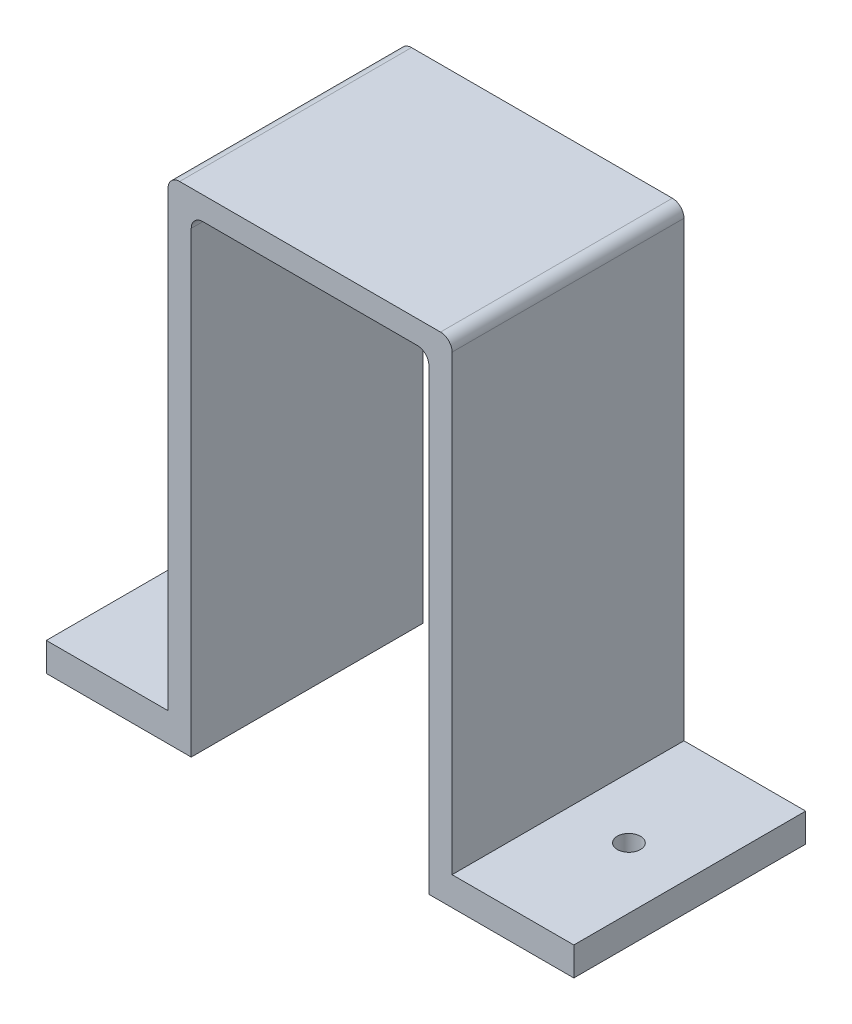
ISO-10303-21;
HEADER;
FILE_DESCRIPTION(('STEP AP214'),'2;1');
FILE_NAME('part.step','',(''),(''),'','','');
FILE_SCHEMA(('AUTOMOTIVE_DESIGN { 1 0 10303 214 1 1 1 1 }'));
ENDSEC;
DATA;
#1=APPLICATION_CONTEXT('core data for automotive mechanical design processes');
#2=APPLICATION_PROTOCOL_DEFINITION('international standard','automotive_design',2000,#1);
#3=PRODUCT_CONTEXT('',#1,'mechanical');
#4=PRODUCT('Part','Part','',(#3));
#5=PRODUCT_RELATED_PRODUCT_CATEGORY('part','',(#4));
#6=PRODUCT_DEFINITION_FORMATION('','',#4);
#7=PRODUCT_DEFINITION_CONTEXT('part definition',#1,'design');
#8=PRODUCT_DEFINITION('design','',#6,#7);
#9=PRODUCT_DEFINITION_SHAPE('','',#8);
#10=(LENGTH_UNIT() NAMED_UNIT(*) SI_UNIT(.MILLI.,.METRE.));
#11=(NAMED_UNIT(*) PLANE_ANGLE_UNIT() SI_UNIT($,.RADIAN.));
#12=(NAMED_UNIT(*) SI_UNIT($,.STERADIAN.) SOLID_ANGLE_UNIT());
#13=UNCERTAINTY_MEASURE_WITH_UNIT(LENGTH_MEASURE(1.E-05),#10,'distance_accuracy_value','');
#14=(GEOMETRIC_REPRESENTATION_CONTEXT(3) GLOBAL_UNCERTAINTY_ASSIGNED_CONTEXT((#13)) GLOBAL_UNIT_ASSIGNED_CONTEXT((#10,
#11,#12)) REPRESENTATION_CONTEXT('',''));
#15=CARTESIAN_POINT('',(0.,0.,0.));
#16=DIRECTION('',(0.,0.,1.));
#17=DIRECTION('',(1.,0.,0.));
#18=AXIS2_PLACEMENT_3D('',#15,#16,#17);
#19=CARTESIAN_POINT('',(-22.5,-10.2652354570637,20.));
#20=DIRECTION('',(-1.,0.,0.));
#21=DIRECTION('',(0.,-1.,0.));
#22=AXIS2_PLACEMENT_3D('',#19,#20,#21);
#23=PLANE('',#22);
#24=DIRECTION('',(0.,1.,0.));
#25=VECTOR('',#24,1.);
#26=CARTESIAN_POINT('',(-22.5,-10.2652354570637,0.));
#27=LINE('',#26,#25);
#28=CARTESIAN_POINT('',(-22.5,-10.2652354570637,0.));
#29=VERTEX_POINT('',#28);
#30=CARTESIAN_POINT('',(-22.5,29.2347645429363,0.));
#31=VERTEX_POINT('',#30);
#32=EDGE_CURVE('E163',#29,#31,#27,.T.);
#33=ORIENTED_EDGE('',*,*,#32,.T.);
#34=DIRECTION('',(0.,0.,-1.));
#35=VECTOR('',#34,1.);
#36=CARTESIAN_POINT('',(-22.5,29.2347645429363,20.));
#37=LINE('',#36,#35);
#38=CARTESIAN_POINT('',(-22.5,29.2347645429363,20.));
#39=VERTEX_POINT('',#38);
#40=EDGE_CURVE('E256',#31,#39,#37,.F.);
#41=ORIENTED_EDGE('',*,*,#40,.T.);
#42=DIRECTION('',(0.,1.,0.));
#43=VECTOR('',#42,1.);
#44=CARTESIAN_POINT('',(-22.5,-10.2652354570637,20.));
#45=LINE('',#44,#43);
#46=CARTESIAN_POINT('',(-22.5,-10.2652354570637,20.));
#47=VERTEX_POINT('',#46);
#48=EDGE_CURVE('E172',#47,#39,#45,.T.);
#49=ORIENTED_EDGE('',*,*,#48,.F.);
#50=DIRECTION('',(0.,0.,-1.));
#51=VECTOR('',#50,1.);
#52=CARTESIAN_POINT('',(-22.5,-10.2652354570637,20.));
#53=LINE('',#52,#51);
#54=EDGE_CURVE('E158',#47,#29,#53,.T.);
#55=ORIENTED_EDGE('',*,*,#54,.T.);
#56=EDGE_LOOP('',(#33,#41,#49,#55));
#57=FACE_BOUND('',#56,.T.);
#58=ADVANCED_FACE('F37',(#57),#23,.F.);
#59=CARTESIAN_POINT('',(-22.5,30.2347645429363,20.));
#60=DIRECTION('',(0.,1.,0.));
#61=DIRECTION('',(-1.,0.,0.));
#62=AXIS2_PLACEMENT_3D('',#59,#60,#61);
#63=PLANE('',#62);
#64=DIRECTION('',(1.,0.,0.));
#65=VECTOR('',#64,1.);
#66=CARTESIAN_POINT('',(-22.5,30.2347645429363,0.));
#67=LINE('',#66,#65);
#68=CARTESIAN_POINT('',(-21.5,30.2347645429363,0.));
#69=VERTEX_POINT('',#68);
#70=CARTESIAN_POINT('',(-3.,30.2347645429363,0.));
#71=VERTEX_POINT('',#70);
#72=EDGE_CURVE('E227',#69,#71,#67,.T.);
#73=ORIENTED_EDGE('',*,*,#72,.T.);
#74=DIRECTION('',(0.,0.,-1.));
#75=VECTOR('',#74,1.);
#76=CARTESIAN_POINT('',(-3.,30.2347645429363,20.));
#77=LINE('',#76,#75);
#78=CARTESIAN_POINT('',(-3.,30.2347645429363,20.));
#79=VERTEX_POINT('',#78);
#80=EDGE_CURVE('E254',#71,#79,#77,.F.);
#81=ORIENTED_EDGE('',*,*,#80,.T.);
#82=DIRECTION('',(1.,0.,0.));
#83=VECTOR('',#82,1.);
#84=CARTESIAN_POINT('',(-22.5,30.2347645429363,20.));
#85=LINE('',#84,#83);
#86=CARTESIAN_POINT('',(-21.5,30.2347645429363,20.));
#87=VERTEX_POINT('',#86);
#88=EDGE_CURVE('E198',#87,#79,#85,.T.);
#89=ORIENTED_EDGE('',*,*,#88,.F.);
#90=DIRECTION('',(0.,0.,-1.));
#91=VECTOR('',#90,1.);
#92=CARTESIAN_POINT('',(-21.5,30.2347645429363,0.));
#93=LINE('',#92,#91);
#94=EDGE_CURVE('E251',#87,#69,#93,.T.);
#95=ORIENTED_EDGE('',*,*,#94,.T.);
#96=EDGE_LOOP('',(#73,#81,#89,#95));
#97=FACE_BOUND('',#96,.T.);
#98=ADVANCED_FACE('F291',(#97),#63,.F.);
#99=CARTESIAN_POINT('',(-2.,30.2347645429363,20.));
#100=DIRECTION('',(1.,0.,0.));
#101=DIRECTION('',(0.,1.,0.));
#102=AXIS2_PLACEMENT_3D('',#99,#100,#101);
#103=PLANE('',#102);
#104=DIRECTION('',(0.,-1.,0.));
#105=VECTOR('',#104,1.);
#106=CARTESIAN_POINT('',(-2.,30.2347645429363,20.));
#107=LINE('',#106,#105);
#108=CARTESIAN_POINT('',(-2.,29.2347645429363,20.));
#109=VERTEX_POINT('',#108);
#110=CARTESIAN_POINT('',(-2.,-10.2652354570637,20.));
#111=VERTEX_POINT('',#110);
#112=EDGE_CURVE('E196',#109,#111,#107,.T.);
#113=ORIENTED_EDGE('',*,*,#112,.F.);
#114=DIRECTION('',(0.,0.,-1.));
#115=VECTOR('',#114,1.);
#116=CARTESIAN_POINT('',(-2.,29.2347645429363,0.));
#117=LINE('',#116,#115);
#118=CARTESIAN_POINT('',(-2.,29.2347645429363,0.));
#119=VERTEX_POINT('',#118);
#120=EDGE_CURVE('E233',#109,#119,#117,.T.);
#121=ORIENTED_EDGE('',*,*,#120,.T.);
#122=DIRECTION('',(0.,-1.,0.));
#123=VECTOR('',#122,1.);
#124=CARTESIAN_POINT('',(-2.,30.2347645429363,0.));
#125=LINE('',#124,#123);
#126=CARTESIAN_POINT('',(-2.,-10.2652354570637,0.));
#127=VERTEX_POINT('',#126);
#128=EDGE_CURVE('E225',#119,#127,#125,.T.);
#129=ORIENTED_EDGE('',*,*,#128,.T.);
#130=DIRECTION('',(0.,0.,-1.));
#131=VECTOR('',#130,1.);
#132=CARTESIAN_POINT('',(-2.,-10.2652354570637,20.));
#133=LINE('',#132,#131);
#134=EDGE_CURVE('E234',#111,#127,#133,.T.);
#135=ORIENTED_EDGE('',*,*,#134,.F.);
#136=EDGE_LOOP('',(#113,#121,#129,#135));
#137=FACE_BOUND('',#136,.T.);
#138=ADVANCED_FACE('F300',(#137),#103,.F.);
#139=CARTESIAN_POINT('',(0.,-10.2652354570637,20.));
#140=DIRECTION('',(0.,-1.,0.));
#141=DIRECTION('',(0.,0.,-1.));
#142=AXIS2_PLACEMENT_3D('',#139,#140,#141);
#143=PLANE('',#142);
#144=CARTESIAN_POINT('',(5.25,-10.2652354570637,10.));
#145=DIRECTION('',(0.,-1.,0.));
#146=DIRECTION('',(0.,0.,-1.));
#147=AXIS2_PLACEMENT_3D('',#144,#145,#146);
#148=CIRCLE('',#147,1.);
#149=CARTESIAN_POINT('',(5.25,-10.2652354570637,9.));
#150=VERTEX_POINT('',#149);
#151=EDGE_CURVE('E204',#150,#150,#148,.T.);
#152=ORIENTED_EDGE('',*,*,#151,.F.);
#153=EDGE_LOOP('',(#152));
#154=FACE_BOUND('',#153,.T.);
#155=DIRECTION('',(-1.,0.,0.));
#156=VECTOR('',#155,1.);
#157=CARTESIAN_POINT('',(0.,-10.2652354570637,0.));
#158=LINE('',#157,#156);
#159=CARTESIAN_POINT('',(10.5,-10.2652354570637,0.));
#160=VERTEX_POINT('',#159);
#161=EDGE_CURVE('E222',#160,#127,#158,.T.);
#162=ORIENTED_EDGE('',*,*,#161,.F.);
#163=DIRECTION('',(0.,0.,-1.));
#164=VECTOR('',#163,1.);
#165=CARTESIAN_POINT('',(10.5,-10.2652354570637,20.));
#166=LINE('',#165,#164);
#167=CARTESIAN_POINT('',(10.5,-10.2652354570637,20.));
#168=VERTEX_POINT('',#167);
#169=EDGE_CURVE('E237',#168,#160,#166,.T.);
#170=ORIENTED_EDGE('',*,*,#169,.F.);
#171=DIRECTION('',(1.,0.,0.));
#172=VECTOR('',#171,1.);
#173=CARTESIAN_POINT('',(0.,-10.2652354570637,20.));
#174=LINE('',#173,#172);
#175=EDGE_CURVE('E194',#111,#168,#174,.T.);
#176=ORIENTED_EDGE('',*,*,#175,.F.);
#177=ORIENTED_EDGE('',*,*,#134,.T.);
#178=EDGE_LOOP('',(#162,#170,#176,#177));
#179=FACE_BOUND('',#178,.T.);
#180=ADVANCED_FACE('F303',(#154,#179),#143,.T.);
#181=CARTESIAN_POINT('',(10.5,-10.2652354570637,20.));
#182=DIRECTION('',(-1.,0.,0.));
#183=DIRECTION('',(0.,0.,1.));
#184=AXIS2_PLACEMENT_3D('',#181,#182,#183);
#185=PLANE('',#184);
#186=DIRECTION('',(0.,1.,0.));
#187=VECTOR('',#186,1.);
#188=CARTESIAN_POINT('',(10.5,-10.2652354570637,0.));
#189=LINE('',#188,#187);
#190=CARTESIAN_POINT('',(10.5,-7.79709141274239,0.));
#191=VERTEX_POINT('',#190);
#192=EDGE_CURVE('E220',#160,#191,#189,.T.);
#193=ORIENTED_EDGE('',*,*,#192,.T.);
#194=DIRECTION('',(0.,0.,-1.));
#195=VECTOR('',#194,1.);
#196=CARTESIAN_POINT('',(10.5,-7.79709141274239,20.));
#197=LINE('',#196,#195);
#198=CARTESIAN_POINT('',(10.5,-7.79709141274239,20.));
#199=VERTEX_POINT('',#198);
#200=EDGE_CURVE('E240',#199,#191,#197,.T.);
#201=ORIENTED_EDGE('',*,*,#200,.F.);
#202=DIRECTION('',(0.,1.,0.));
#203=VECTOR('',#202,1.);
#204=CARTESIAN_POINT('',(10.5,-10.2652354570637,20.));
#205=LINE('',#204,#203);
#206=EDGE_CURVE('E192',#168,#199,#205,.T.);
#207=ORIENTED_EDGE('',*,*,#206,.F.);
#208=ORIENTED_EDGE('',*,*,#169,.T.);
#209=EDGE_LOOP('',(#193,#201,#207,#208));
#210=FACE_BOUND('',#209,.T.);
#211=ADVANCED_FACE('F309',(#210),#185,.F.);
#212=CARTESIAN_POINT('',(10.5,-7.79709141274239,20.));
#213=DIRECTION('',(0.,-1.,0.));
#214=DIRECTION('',(1.,0.,0.));
#215=AXIS2_PLACEMENT_3D('',#212,#213,#214);
#216=PLANE('',#215);
#217=CARTESIAN_POINT('',(5.25,-7.79709141274239,10.));
#218=DIRECTION('',(0.,1.,0.));
#219=DIRECTION('',(0.,0.,1.));
#220=AXIS2_PLACEMENT_3D('',#217,#218,#219);
#221=CIRCLE('',#220,1.);
#222=CARTESIAN_POINT('',(5.25,-7.79709141274239,11.));
#223=VERTEX_POINT('',#222);
#224=EDGE_CURVE('E550',#223,#223,#221,.T.);
#225=ORIENTED_EDGE('',*,*,#224,.F.);
#226=EDGE_LOOP('',(#225));
#227=FACE_BOUND('',#226,.T.);
#228=DIRECTION('',(-1.,0.,0.));
#229=VECTOR('',#228,1.);
#230=CARTESIAN_POINT('',(10.5,-7.79709141274239,0.));
#231=LINE('',#230,#229);
#232=CARTESIAN_POINT('',(0.,-7.79709141274239,0.));
#233=VERTEX_POINT('',#232);
#234=EDGE_CURVE('E217',#191,#233,#231,.T.);
#235=ORIENTED_EDGE('',*,*,#234,.T.);
#236=DIRECTION('',(0.,0.,-1.));
#237=VECTOR('',#236,1.);
#238=CARTESIAN_POINT('',(0.,-7.79709141274239,20.));
#239=LINE('',#238,#237);
#240=CARTESIAN_POINT('',(0.,-7.79709141274239,20.));
#241=VERTEX_POINT('',#240);
#242=EDGE_CURVE('E243',#241,#233,#239,.T.);
#243=ORIENTED_EDGE('',*,*,#242,.F.);
#244=DIRECTION('',(-1.,0.,0.));
#245=VECTOR('',#244,1.);
#246=CARTESIAN_POINT('',(10.5,-7.79709141274239,20.));
#247=LINE('',#246,#245);
#248=EDGE_CURVE('E189',#199,#241,#247,.T.);
#249=ORIENTED_EDGE('',*,*,#248,.F.);
#250=ORIENTED_EDGE('',*,*,#200,.T.);
#251=EDGE_LOOP('',(#235,#243,#249,#250));
#252=FACE_BOUND('',#251,.T.);
#253=ADVANCED_FACE('F313',(#227,#252),#216,.F.);
#254=CARTESIAN_POINT('',(0.,32.2347645429363,20.));
#255=DIRECTION('',(1.,0.,0.));
#256=DIRECTION('',(0.,0.,-1.));
#257=AXIS2_PLACEMENT_3D('',#254,#255,#256);
#258=PLANE('',#257);
#259=DIRECTION('',(0.,-1.,0.));
#260=VECTOR('',#259,1.);
#261=CARTESIAN_POINT('',(0.,32.2347645429363,0.));
#262=LINE('',#261,#260);
#263=CARTESIAN_POINT('',(0.,31.2347645429363,0.));
#264=VERTEX_POINT('',#263);
#265=EDGE_CURVE('E215',#264,#233,#262,.T.);
#266=ORIENTED_EDGE('',*,*,#265,.F.);
#267=DIRECTION('',(0.,0.,-1.));
#268=VECTOR('',#267,1.);
#269=CARTESIAN_POINT('',(0.,31.2347645429363,20.));
#270=LINE('',#269,#268);
#271=CARTESIAN_POINT('',(0.,31.2347645429363,20.));
#272=VERTEX_POINT('',#271);
#273=EDGE_CURVE('E61',#264,#272,#270,.F.);
#274=ORIENTED_EDGE('',*,*,#273,.T.);
#275=DIRECTION('',(0.,-1.,0.));
#276=VECTOR('',#275,1.);
#277=CARTESIAN_POINT('',(0.,32.2347645429363,20.));
#278=LINE('',#277,#276);
#279=EDGE_CURVE('E187',#272,#241,#278,.T.);
#280=ORIENTED_EDGE('',*,*,#279,.T.);
#281=ORIENTED_EDGE('',*,*,#242,.T.);
#282=EDGE_LOOP('',(#266,#274,#280,#281));
#283=FACE_BOUND('',#282,.T.);
#284=ADVANCED_FACE('F359',(#283),#258,.T.);
#285=CARTESIAN_POINT('',(-24.5,32.2347645429363,20.));
#286=DIRECTION('',(0.,1.,0.));
#287=DIRECTION('',(0.,0.,1.));
#288=AXIS2_PLACEMENT_3D('',#285,#286,#287);
#289=PLANE('',#288);
#290=DIRECTION('',(1.,0.,0.));
#291=VECTOR('',#290,1.);
#292=CARTESIAN_POINT('',(-24.5,32.2347645429363,20.));
#293=LINE('',#292,#291);
#294=CARTESIAN_POINT('',(-23.5,32.2347645429363,20.));
#295=VERTEX_POINT('',#294);
#296=CARTESIAN_POINT('',(-1.,32.2347645429363,20.));
#297=VERTEX_POINT('',#296);
#298=EDGE_CURVE('E184',#295,#297,#293,.T.);
#299=ORIENTED_EDGE('',*,*,#298,.T.);
#300=DIRECTION('',(0.,0.,-1.));
#301=VECTOR('',#300,1.);
#302=CARTESIAN_POINT('',(-1.,32.2347645429363,20.));
#303=LINE('',#302,#301);
#304=CARTESIAN_POINT('',(-1.,32.2347645429363,0.));
#305=VERTEX_POINT('',#304);
#306=EDGE_CURVE('E260',#297,#305,#303,.T.);
#307=ORIENTED_EDGE('',*,*,#306,.T.);
#308=DIRECTION('',(1.,0.,0.));
#309=VECTOR('',#308,1.);
#310=CARTESIAN_POINT('',(-24.5,32.2347645429363,0.));
#311=LINE('',#310,#309);
#312=CARTESIAN_POINT('',(-23.5,32.2347645429363,0.));
#313=VERTEX_POINT('',#312);
#314=EDGE_CURVE('E212',#313,#305,#311,.T.);
#315=ORIENTED_EDGE('',*,*,#314,.F.);
#316=DIRECTION('',(0.,0.,-1.));
#317=VECTOR('',#316,1.);
#318=CARTESIAN_POINT('',(-23.5,32.2347645429363,20.));
#319=LINE('',#318,#317);
#320=EDGE_CURVE('E258',#313,#295,#319,.F.);
#321=ORIENTED_EDGE('',*,*,#320,.T.);
#322=EDGE_LOOP('',(#299,#307,#315,#321));
#323=FACE_BOUND('',#322,.T.);
#324=ADVANCED_FACE('F321',(#323),#289,.T.);
#325=CARTESIAN_POINT('',(-24.5,-7.79709141274239,20.));
#326=DIRECTION('',(-1.,0.,0.));
#327=DIRECTION('',(0.,0.,1.));
#328=AXIS2_PLACEMENT_3D('',#325,#326,#327);
#329=PLANE('',#328);
#330=DIRECTION('',(0.,1.,0.));
#331=VECTOR('',#330,1.);
#332=CARTESIAN_POINT('',(-24.5,-7.79709141274239,20.));
#333=LINE('',#332,#331);
#334=CARTESIAN_POINT('',(-24.5,-7.79709141274239,20.));
#335=VERTEX_POINT('',#334);
#336=CARTESIAN_POINT('',(-24.5,31.2347645429363,20.));
#337=VERTEX_POINT('',#336);
#338=EDGE_CURVE('E179',#335,#337,#333,.T.);
#339=ORIENTED_EDGE('',*,*,#338,.T.);
#340=DIRECTION('',(0.,0.,-1.));
#341=VECTOR('',#340,1.);
#342=CARTESIAN_POINT('',(-24.5,31.2347645429363,20.));
#343=LINE('',#342,#341);
#344=CARTESIAN_POINT('',(-24.5,31.2347645429363,0.));
#345=VERTEX_POINT('',#344);
#346=EDGE_CURVE('E271',#337,#345,#343,.T.);
#347=ORIENTED_EDGE('',*,*,#346,.T.);
#348=DIRECTION('',(0.,1.,0.));
#349=VECTOR('',#348,1.);
#350=CARTESIAN_POINT('',(-24.5,-7.79709141274239,0.));
#351=LINE('',#350,#349);
#352=CARTESIAN_POINT('',(-24.5,-7.79709141274239,0.));
#353=VERTEX_POINT('',#352);
#354=EDGE_CURVE('E209',#353,#345,#351,.T.);
#355=ORIENTED_EDGE('',*,*,#354,.F.);
#356=DIRECTION('',(0.,0.,-1.));
#357=VECTOR('',#356,1.);
#358=CARTESIAN_POINT('',(-24.5,-7.79709141274239,20.));
#359=LINE('',#358,#357);
#360=EDGE_CURVE('E246',#335,#353,#359,.T.);
#361=ORIENTED_EDGE('',*,*,#360,.F.);
#362=EDGE_LOOP('',(#339,#347,#355,#361));
#363=FACE_BOUND('',#362,.T.);
#364=ADVANCED_FACE('F327',(#363),#329,.T.);
#365=CARTESIAN_POINT('',(-35.,-7.79709141274239,20.));
#366=DIRECTION('',(0.,1.,0.));
#367=DIRECTION('',(0.,0.,1.));
#368=AXIS2_PLACEMENT_3D('',#365,#366,#367);
#369=PLANE('',#368);
#370=CARTESIAN_POINT('',(-29.75,-7.79709141274239,10.));
#371=DIRECTION('',(0.,1.,0.));
#372=DIRECTION('',(0.,0.,1.));
#373=AXIS2_PLACEMENT_3D('',#370,#371,#372);
#374=CIRCLE('',#373,1.);
#375=CARTESIAN_POINT('',(-29.75,-7.79709141274239,11.));
#376=VERTEX_POINT('',#375);
#377=EDGE_CURVE('E551',#376,#376,#374,.T.);
#378=ORIENTED_EDGE('',*,*,#377,.F.);
#379=EDGE_LOOP('',(#378));
#380=FACE_BOUND('',#379,.T.);
#381=DIRECTION('',(1.,0.,0.));
#382=VECTOR('',#381,1.);
#383=CARTESIAN_POINT('',(-35.,-7.79709141274239,0.));
#384=LINE('',#383,#382);
#385=CARTESIAN_POINT('',(-35.,-7.79709141274239,0.));
#386=VERTEX_POINT('',#385);
#387=EDGE_CURVE('E206',#386,#353,#384,.T.);
#388=ORIENTED_EDGE('',*,*,#387,.F.);
#389=DIRECTION('',(0.,0.,-1.));
#390=VECTOR('',#389,1.);
#391=CARTESIAN_POINT('',(-35.,-7.79709141274239,20.));
#392=LINE('',#391,#390);
#393=CARTESIAN_POINT('',(-35.,-7.79709141274239,20.));
#394=VERTEX_POINT('',#393);
#395=EDGE_CURVE('E171',#394,#386,#392,.T.);
#396=ORIENTED_EDGE('',*,*,#395,.F.);
#397=DIRECTION('',(1.,0.,0.));
#398=VECTOR('',#397,1.);
#399=CARTESIAN_POINT('',(-35.,-7.79709141274239,20.));
#400=LINE('',#399,#398);
#401=EDGE_CURVE('E177',#394,#335,#400,.T.);
#402=ORIENTED_EDGE('',*,*,#401,.T.);
#403=ORIENTED_EDGE('',*,*,#360,.T.);
#404=EDGE_LOOP('',(#388,#396,#402,#403));
#405=FACE_BOUND('',#404,.T.);
#406=ADVANCED_FACE('F330',(#380,#405),#369,.T.);
#407=CARTESIAN_POINT('',(-35.,-10.2652354570637,20.));
#408=DIRECTION('',(-1.,0.,0.));
#409=DIRECTION('',(0.,0.,1.));
#410=AXIS2_PLACEMENT_3D('',#407,#408,#409);
#411=PLANE('',#410);
#412=DIRECTION('',(0.,1.,0.));
#413=VECTOR('',#412,1.);
#414=CARTESIAN_POINT('',(-35.,-10.2652354570637,0.));
#415=LINE('',#414,#413);
#416=CARTESIAN_POINT('',(-35.,-10.2652354570637,0.));
#417=VERTEX_POINT('',#416);
#418=EDGE_CURVE('E169',#417,#386,#415,.T.);
#419=ORIENTED_EDGE('',*,*,#418,.F.);
#420=DIRECTION('',(0.,0.,-1.));
#421=VECTOR('',#420,1.);
#422=CARTESIAN_POINT('',(-35.,-10.2652354570637,20.));
#423=LINE('',#422,#421);
#424=CARTESIAN_POINT('',(-35.,-10.2652354570637,20.));
#425=VERTEX_POINT('',#424);
#426=EDGE_CURVE('E155',#425,#417,#423,.T.);
#427=ORIENTED_EDGE('',*,*,#426,.F.);
#428=DIRECTION('',(0.,1.,0.));
#429=VECTOR('',#428,1.);
#430=CARTESIAN_POINT('',(-35.,-10.2652354570637,20.));
#431=LINE('',#430,#429);
#432=EDGE_CURVE('E162',#425,#394,#431,.T.);
#433=ORIENTED_EDGE('',*,*,#432,.T.);
#434=ORIENTED_EDGE('',*,*,#395,.T.);
#435=EDGE_LOOP('',(#419,#427,#433,#434));
#436=FACE_BOUND('',#435,.T.);
#437=ADVANCED_FACE('F167',(#436),#411,.T.);
#438=CARTESIAN_POINT('',(-26.0678670360111,-10.2652354570637,20.));
#439=DIRECTION('',(0.,-1.,0.));
#440=DIRECTION('',(0.,0.,-1.));
#441=AXIS2_PLACEMENT_3D('',#438,#439,#440);
#442=PLANE('',#441);
#443=CARTESIAN_POINT('',(-29.75,-10.2652354570637,10.));
#444=DIRECTION('',(0.,-1.,0.));
#445=DIRECTION('',(0.,0.,-1.));
#446=AXIS2_PLACEMENT_3D('',#443,#444,#445);
#447=CIRCLE('',#446,1.);
#448=CARTESIAN_POINT('',(-29.75,-10.2652354570637,9.));
#449=VERTEX_POINT('',#448);
#450=EDGE_CURVE('E41',#449,#449,#447,.T.);
#451=ORIENTED_EDGE('',*,*,#450,.F.);
#452=EDGE_LOOP('',(#451));
#453=FACE_BOUND('',#452,.T.);
#454=DIRECTION('',(-1.,0.,0.));
#455=VECTOR('',#454,1.);
#456=CARTESIAN_POINT('',(-26.0678670360111,-10.2652354570637,0.));
#457=LINE('',#456,#455);
#458=EDGE_CURVE('E202',#29,#417,#457,.T.);
#459=ORIENTED_EDGE('',*,*,#458,.F.);
#460=ORIENTED_EDGE('',*,*,#54,.F.);
#461=DIRECTION('',(-1.,0.,0.));
#462=VECTOR('',#461,1.);
#463=CARTESIAN_POINT('',(-22.5,-10.2652354570637,20.));
#464=LINE('',#463,#462);
#465=EDGE_CURVE('E152',#47,#425,#464,.T.);
#466=ORIENTED_EDGE('',*,*,#465,.T.);
#467=ORIENTED_EDGE('',*,*,#426,.T.);
#468=EDGE_LOOP('',(#459,#460,#466,#467));
#469=FACE_BOUND('',#468,.T.);
#470=ADVANCED_FACE('F154',(#453,#469),#442,.T.);
#471=CARTESIAN_POINT('',(0.,0.,20.));
#472=DIRECTION('',(0.,0.,-1.));
#473=DIRECTION('',(-1.,0.,0.));
#474=AXIS2_PLACEMENT_3D('',#471,#472,#473);
#475=PLANE('',#474);
#476=ORIENTED_EDGE('',*,*,#279,.F.);
#477=CARTESIAN_POINT('',(-1.,31.2347645429363,20.));
#478=DIRECTION('',(0.,0.,-1.));
#479=DIRECTION('',(-1.,0.,0.));
#480=AXIS2_PLACEMENT_3D('',#477,#478,#479);
#481=CIRCLE('',#480,1.);
#482=EDGE_CURVE('E269',#272,#297,#481,.F.);
#483=ORIENTED_EDGE('',*,*,#482,.T.);
#484=ORIENTED_EDGE('',*,*,#298,.F.);
#485=CARTESIAN_POINT('',(-23.5,31.2347645429363,20.));
#486=DIRECTION('',(0.,0.,-1.));
#487=DIRECTION('',(-1.,0.,0.));
#488=AXIS2_PLACEMENT_3D('',#485,#486,#487);
#489=CIRCLE('',#488,1.);
#490=EDGE_CURVE('E53',#295,#337,#489,.F.);
#491=ORIENTED_EDGE('',*,*,#490,.T.);
#492=ORIENTED_EDGE('',*,*,#338,.F.);
#493=ORIENTED_EDGE('',*,*,#401,.F.);
#494=ORIENTED_EDGE('',*,*,#432,.F.);
#495=ORIENTED_EDGE('',*,*,#465,.F.);
#496=ORIENTED_EDGE('',*,*,#48,.T.);
#497=CARTESIAN_POINT('',(-21.5,29.2347645429363,20.));
#498=DIRECTION('',(0.,0.,-1.));
#499=DIRECTION('',(-1.,0.,0.));
#500=AXIS2_PLACEMENT_3D('',#497,#498,#499);
#501=CIRCLE('',#500,1.);
#502=EDGE_CURVE('E11',#39,#87,#501,.T.);
#503=ORIENTED_EDGE('',*,*,#502,.T.);
#504=ORIENTED_EDGE('',*,*,#88,.T.);
#505=CARTESIAN_POINT('',(-3.,29.2347645429363,20.));
#506=DIRECTION('',(0.,0.,-1.));
#507=DIRECTION('',(-1.,0.,0.));
#508=AXIS2_PLACEMENT_3D('',#505,#506,#507);
#509=CIRCLE('',#508,1.);
#510=EDGE_CURVE('E276',#79,#109,#509,.T.);
#511=ORIENTED_EDGE('',*,*,#510,.T.);
#512=ORIENTED_EDGE('',*,*,#112,.T.);
#513=ORIENTED_EDGE('',*,*,#175,.T.);
#514=ORIENTED_EDGE('',*,*,#206,.T.);
#515=ORIENTED_EDGE('',*,*,#248,.T.);
#516=EDGE_LOOP('',(#476,#483,#484,#491,#492,#493,#494,#495,#496,#503,#504,#511,#512,#513,#514,#515));
#517=FACE_BOUND('',#516,.T.);
#518=ADVANCED_FACE('F175',(#517),#475,.F.);
#519=CARTESIAN_POINT('',(0.,0.,0.));
#520=DIRECTION('',(0.,0.,-1.));
#521=DIRECTION('',(-1.,0.,0.));
#522=AXIS2_PLACEMENT_3D('',#519,#520,#521);
#523=PLANE('',#522);
#524=ORIENTED_EDGE('',*,*,#314,.T.);
#525=CARTESIAN_POINT('',(-1.,31.2347645429363,0.));
#526=DIRECTION('',(0.,0.,-1.));
#527=DIRECTION('',(-1.,0.,0.));
#528=AXIS2_PLACEMENT_3D('',#525,#526,#527);
#529=CIRCLE('',#528,1.);
#530=EDGE_CURVE('E265',#305,#264,#529,.T.);
#531=ORIENTED_EDGE('',*,*,#530,.T.);
#532=ORIENTED_EDGE('',*,*,#265,.T.);
#533=ORIENTED_EDGE('',*,*,#234,.F.);
#534=ORIENTED_EDGE('',*,*,#192,.F.);
#535=ORIENTED_EDGE('',*,*,#161,.T.);
#536=ORIENTED_EDGE('',*,*,#128,.F.);
#537=CARTESIAN_POINT('',(-3.,29.2347645429363,0.));
#538=DIRECTION('',(0.,0.,-1.));
#539=DIRECTION('',(-1.,0.,0.));
#540=AXIS2_PLACEMENT_3D('',#537,#538,#539);
#541=CIRCLE('',#540,1.);
#542=EDGE_CURVE('E274',#119,#71,#541,.F.);
#543=ORIENTED_EDGE('',*,*,#542,.T.);
#544=ORIENTED_EDGE('',*,*,#72,.F.);
#545=CARTESIAN_POINT('',(-21.5,29.2347645429363,0.));
#546=DIRECTION('',(0.,0.,-1.));
#547=DIRECTION('',(-1.,0.,0.));
#548=AXIS2_PLACEMENT_3D('',#545,#546,#547);
#549=CIRCLE('',#548,1.);
#550=EDGE_CURVE('E46',#69,#31,#549,.F.);
#551=ORIENTED_EDGE('',*,*,#550,.T.);
#552=ORIENTED_EDGE('',*,*,#32,.F.);
#553=ORIENTED_EDGE('',*,*,#458,.T.);
#554=ORIENTED_EDGE('',*,*,#418,.T.);
#555=ORIENTED_EDGE('',*,*,#387,.T.);
#556=ORIENTED_EDGE('',*,*,#354,.T.);
#557=CARTESIAN_POINT('',(-23.5,31.2347645429363,0.));
#558=DIRECTION('',(0.,0.,-1.));
#559=DIRECTION('',(-1.,0.,0.));
#560=AXIS2_PLACEMENT_3D('',#557,#558,#559);
#561=CIRCLE('',#560,1.);
#562=EDGE_CURVE('E263',#345,#313,#561,.T.);
#563=ORIENTED_EDGE('',*,*,#562,.T.);
#564=EDGE_LOOP('',(#524,#531,#532,#533,#534,#535,#536,#543,#544,#551,#552,#553,#554,#555,#556,#563));
#565=FACE_BOUND('',#564,.T.);
#566=ADVANCED_FACE('F281',(#565),#523,.T.);
#567=CARTESIAN_POINT('',(-3.,29.2347645429363,20.));
#568=DIRECTION('',(0.,0.,1.));
#569=DIRECTION('',(1.,0.,0.));
#570=AXIS2_PLACEMENT_3D('',#567,#568,#569);
#571=CYLINDRICAL_SURFACE('',#570,1.);
#572=ORIENTED_EDGE('',*,*,#510,.F.);
#573=ORIENTED_EDGE('',*,*,#80,.F.);
#574=ORIENTED_EDGE('',*,*,#542,.F.);
#575=ORIENTED_EDGE('',*,*,#120,.F.);
#576=EDGE_LOOP('',(#572,#573,#574,#575));
#577=FACE_BOUND('',#576,.T.);
#578=ADVANCED_FACE('F294',(#577),#571,.F.);
#579=CARTESIAN_POINT('',(-21.5,29.2347645429363,20.));
#580=DIRECTION('',(0.,0.,1.));
#581=DIRECTION('',(1.,0.,0.));
#582=AXIS2_PLACEMENT_3D('',#579,#580,#581);
#583=CYLINDRICAL_SURFACE('',#582,1.);
#584=ORIENTED_EDGE('',*,*,#502,.F.);
#585=ORIENTED_EDGE('',*,*,#40,.F.);
#586=ORIENTED_EDGE('',*,*,#550,.F.);
#587=ORIENTED_EDGE('',*,*,#94,.F.);
#588=EDGE_LOOP('',(#584,#585,#586,#587));
#589=FACE_BOUND('',#588,.T.);
#590=ADVANCED_FACE('F287',(#589),#583,.F.);
#591=CARTESIAN_POINT('',(-1.,31.2347645429363,20.));
#592=DIRECTION('',(0.,0.,-1.));
#593=DIRECTION('',(-1.,0.,0.));
#594=AXIS2_PLACEMENT_3D('',#591,#592,#593);
#595=CYLINDRICAL_SURFACE('',#594,1.);
#596=ORIENTED_EDGE('',*,*,#482,.F.);
#597=ORIENTED_EDGE('',*,*,#273,.F.);
#598=ORIENTED_EDGE('',*,*,#530,.F.);
#599=ORIENTED_EDGE('',*,*,#306,.F.);
#600=EDGE_LOOP('',(#596,#597,#598,#599));
#601=FACE_BOUND('',#600,.T.);
#602=ADVANCED_FACE('F318',(#601),#595,.T.);
#603=CARTESIAN_POINT('',(-23.5,31.2347645429363,20.));
#604=DIRECTION('',(0.,0.,-1.));
#605=DIRECTION('',(-1.,0.,0.));
#606=AXIS2_PLACEMENT_3D('',#603,#604,#605);
#607=CYLINDRICAL_SURFACE('',#606,1.);
#608=ORIENTED_EDGE('',*,*,#490,.F.);
#609=ORIENTED_EDGE('',*,*,#320,.F.);
#610=ORIENTED_EDGE('',*,*,#562,.F.);
#611=ORIENTED_EDGE('',*,*,#346,.F.);
#612=EDGE_LOOP('',(#608,#609,#610,#611));
#613=FACE_BOUND('',#612,.T.);
#614=ADVANCED_FACE('F39',(#613),#607,.T.);
#615=CARTESIAN_POINT('',(-29.75,-27.7970914127424,10.));
#616=DIRECTION('',(0.,1.,0.));
#617=DIRECTION('',(0.,0.,1.));
#618=AXIS2_PLACEMENT_3D('',#615,#616,#617);
#619=CYLINDRICAL_SURFACE('',#618,1.);
#620=ORIENTED_EDGE('',*,*,#450,.T.);
#621=EDGE_LOOP('',(#620));
#622=FACE_BOUND('',#621,.T.);
#623=ORIENTED_EDGE('',*,*,#377,.T.);
#624=EDGE_LOOP('',(#623));
#625=FACE_BOUND('',#624,.T.);
#626=ADVANCED_FACE('F427',(#622,#625),#619,.F.);
#627=CARTESIAN_POINT('',(5.25,-27.7970914127424,10.));
#628=DIRECTION('',(0.,1.,0.));
#629=DIRECTION('',(0.,0.,1.));
#630=AXIS2_PLACEMENT_3D('',#627,#628,#629);
#631=CYLINDRICAL_SURFACE('',#630,1.);
#632=ORIENTED_EDGE('',*,*,#151,.T.);
#633=EDGE_LOOP('',(#632));
#634=FACE_BOUND('',#633,.T.);
#635=ORIENTED_EDGE('',*,*,#224,.T.);
#636=EDGE_LOOP('',(#635));
#637=FACE_BOUND('',#636,.T.);
#638=ADVANCED_FACE('F465',(#634,#637),#631,.F.);
#639=CLOSED_SHELL('',(#58,#98,#138,#180,#211,#253,#284,#324,#364,#406,#437,#470,#518,#566,#578,
#590,#602,#614,#626,#638));
#640=MANIFOLD_SOLID_BREP('B2',#639);
#641=ADVANCED_BREP_SHAPE_REPRESENTATION('',(#18,#640),#14);
#642=SHAPE_DEFINITION_REPRESENTATION(#9,#641);
ENDSEC;
END-ISO-10303-21;
